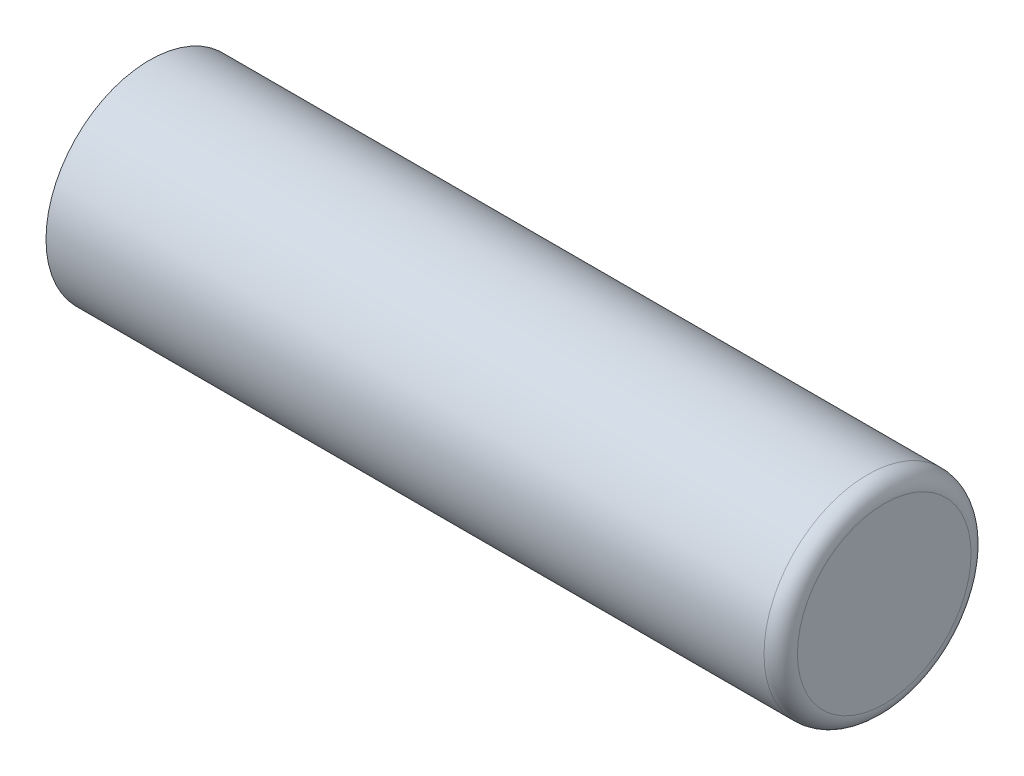
ISO-10303-21;
HEADER;
FILE_DESCRIPTION(('STEP AP214'),'2;1');
FILE_NAME('part.step','',(''),(''),'','','');
FILE_SCHEMA(('AUTOMOTIVE_DESIGN { 1 0 10303 214 1 1 1 1 }'));
ENDSEC;
DATA;
#1=APPLICATION_CONTEXT('core data for automotive mechanical design processes');
#2=APPLICATION_PROTOCOL_DEFINITION('international standard','automotive_design',2000,#1);
#3=PRODUCT_CONTEXT('',#1,'mechanical');
#4=PRODUCT('Part','Part','',(#3));
#5=PRODUCT_RELATED_PRODUCT_CATEGORY('part','',(#4));
#6=PRODUCT_DEFINITION_FORMATION('','',#4);
#7=PRODUCT_DEFINITION_CONTEXT('part definition',#1,'design');
#8=PRODUCT_DEFINITION('design','',#6,#7);
#9=PRODUCT_DEFINITION_SHAPE('','',#8);
#10=(LENGTH_UNIT() NAMED_UNIT(*) SI_UNIT(.MILLI.,.METRE.));
#11=(NAMED_UNIT(*) PLANE_ANGLE_UNIT() SI_UNIT($,.RADIAN.));
#12=(NAMED_UNIT(*) SI_UNIT($,.STERADIAN.) SOLID_ANGLE_UNIT());
#13=UNCERTAINTY_MEASURE_WITH_UNIT(LENGTH_MEASURE(1.E-05),#10,'distance_accuracy_value','');
#14=(GEOMETRIC_REPRESENTATION_CONTEXT(3) GLOBAL_UNCERTAINTY_ASSIGNED_CONTEXT((#13)) GLOBAL_UNIT_ASSIGNED_CONTEXT((#10,
#11,#12)) REPRESENTATION_CONTEXT('',''));
#15=CARTESIAN_POINT('',(0.,0.,0.));
#16=DIRECTION('',(0.,0.,1.));
#17=DIRECTION('',(1.,0.,0.));
#18=AXIS2_PLACEMENT_3D('',#15,#16,#17);
#19=CARTESIAN_POINT('',(11.,0.,-2.60000000000001));
#20=DIRECTION('',(-1.,0.,0.));
#21=DIRECTION('',(0.,0.,1.));
#22=AXIS2_PLACEMENT_3D('',#19,#20,#21);
#23=PLANE('',#22);
#24=CARTESIAN_POINT('',(11.,0.,0.));
#25=DIRECTION('',(-1.,0.,0.));
#26=DIRECTION('',(0.,0.,1.));
#27=AXIS2_PLACEMENT_3D('',#24,#25,#26);
#28=CIRCLE('',#27,2.60000000000001);
#29=CARTESIAN_POINT('',(11.,0.,2.60000000000001));
#30=VERTEX_POINT('',#29);
#31=EDGE_CURVE('E43',#30,#30,#28,.T.);
#32=ORIENTED_EDGE('',*,*,#31,.F.);
#33=EDGE_LOOP('',(#32));
#34=FACE_BOUND('',#33,.T.);
#35=ADVANCED_FACE('F33',(#34),#23,.F.);
#36=CARTESIAN_POINT('',(-11.,0.,-3.10000000000001));
#37=DIRECTION('',(1.,0.,0.));
#38=DIRECTION('',(0.,0.,-1.));
#39=AXIS2_PLACEMENT_3D('',#36,#37,#38);
#40=PLANE('',#39);
#41=CARTESIAN_POINT('',(-11.,0.,0.));
#42=DIRECTION('',(-1.,0.,0.));
#43=DIRECTION('',(0.,0.,1.));
#44=AXIS2_PLACEMENT_3D('',#41,#42,#43);
#45=CIRCLE('',#44,3.10000000000001);
#46=CARTESIAN_POINT('',(-11.,0.,3.10000000000001));
#47=VERTEX_POINT('',#46);
#48=EDGE_CURVE('E10',#47,#47,#45,.T.);
#49=ORIENTED_EDGE('',*,*,#48,.T.);
#50=EDGE_LOOP('',(#49));
#51=FACE_BOUND('',#50,.T.);
#52=ADVANCED_FACE('F53',(#51),#40,.F.);
#53=CARTESIAN_POINT('',(-11.,0.,0.));
#54=DIRECTION('',(-1.,0.,0.));
#55=DIRECTION('',(0.,0.,1.));
#56=AXIS2_PLACEMENT_3D('',#53,#54,#55);
#57=CYLINDRICAL_SURFACE('',#56,3.10000000000001);
#58=ORIENTED_EDGE('',*,*,#48,.F.);
#59=EDGE_LOOP('',(#58));
#60=FACE_BOUND('',#59,.T.);
#61=CARTESIAN_POINT('',(10.5,0.,0.));
#62=DIRECTION('',(-1.,0.,0.));
#63=DIRECTION('',(0.,0.,1.));
#64=AXIS2_PLACEMENT_3D('',#61,#62,#63);
#65=CIRCLE('',#64,3.10000000000001);
#66=CARTESIAN_POINT('',(10.5,0.,3.10000000000001));
#67=VERTEX_POINT('',#66);
#68=EDGE_CURVE('E39',#67,#67,#65,.T.);
#69=ORIENTED_EDGE('',*,*,#68,.T.);
#70=EDGE_LOOP('',(#69));
#71=FACE_BOUND('',#70,.T.);
#72=ADVANCED_FACE('F57',(#60,#71),#57,.T.);
#73=CARTESIAN_POINT('',(10.5,0.,0.));
#74=DIRECTION('',(-1.,0.,0.));
#75=DIRECTION('',(0.,0.,1.));
#76=AXIS2_PLACEMENT_3D('',#73,#74,#75);
#77=TOROIDAL_SURFACE('',#76,2.60000000000001,0.5);
#78=ORIENTED_EDGE('',*,*,#68,.F.);
#79=EDGE_LOOP('',(#78));
#80=FACE_BOUND('',#79,.T.);
#81=ORIENTED_EDGE('',*,*,#31,.T.);
#82=EDGE_LOOP('',(#81));
#83=FACE_BOUND('',#82,.T.);
#84=ADVANCED_FACE('F50',(#80,#83),#77,.T.);
#85=CLOSED_SHELL('',(#35,#52,#72,#84));
#86=MANIFOLD_SOLID_BREP('B2',#85);
#87=ADVANCED_BREP_SHAPE_REPRESENTATION('',(#18,#86),#14);
#88=SHAPE_DEFINITION_REPRESENTATION(#9,#87);
ENDSEC;
END-ISO-10303-21;
